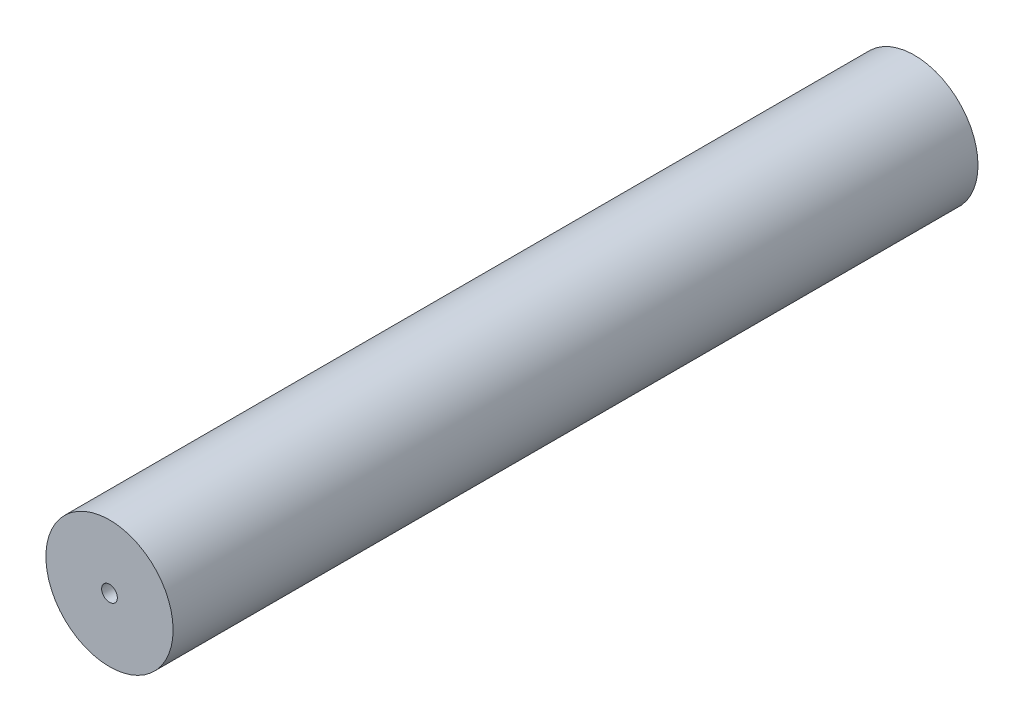
ISO-10303-21;
HEADER;
FILE_DESCRIPTION(('STEP AP214'),'2;1');
FILE_NAME('part.step','',(''),(''),'','','');
FILE_SCHEMA(('AUTOMOTIVE_DESIGN { 1 0 10303 214 1 1 1 1 }'));
ENDSEC;
DATA;
#1=APPLICATION_CONTEXT('core data for automotive mechanical design processes');
#2=APPLICATION_PROTOCOL_DEFINITION('international standard','automotive_design',2000,#1);
#3=PRODUCT_CONTEXT('',#1,'mechanical');
#4=PRODUCT('Part','Part','',(#3));
#5=PRODUCT_RELATED_PRODUCT_CATEGORY('part','',(#4));
#6=PRODUCT_DEFINITION_FORMATION('','',#4);
#7=PRODUCT_DEFINITION_CONTEXT('part definition',#1,'design');
#8=PRODUCT_DEFINITION('design','',#6,#7);
#9=PRODUCT_DEFINITION_SHAPE('','',#8);
#10=(LENGTH_UNIT() NAMED_UNIT(*) SI_UNIT(.MILLI.,.METRE.));
#11=(NAMED_UNIT(*) PLANE_ANGLE_UNIT() SI_UNIT($,.RADIAN.));
#12=(NAMED_UNIT(*) SI_UNIT($,.STERADIAN.) SOLID_ANGLE_UNIT());
#13=UNCERTAINTY_MEASURE_WITH_UNIT(LENGTH_MEASURE(1.E-05),#10,'distance_accuracy_value','');
#14=(GEOMETRIC_REPRESENTATION_CONTEXT(3) GLOBAL_UNCERTAINTY_ASSIGNED_CONTEXT((#13)) GLOBAL_UNIT_ASSIGNED_CONTEXT((#10,
#11,#12)) REPRESENTATION_CONTEXT('',''));
#15=CARTESIAN_POINT('',(0.,0.,0.));
#16=DIRECTION('',(0.,0.,1.));
#17=DIRECTION('',(1.,0.,0.));
#18=AXIS2_PLACEMENT_3D('',#15,#16,#17);
#19=CARTESIAN_POINT('',(0.,0.,40.));
#20=DIRECTION('',(0.,0.,-1.));
#21=DIRECTION('',(-1.,0.,0.));
#22=AXIS2_PLACEMENT_3D('',#19,#20,#21);
#23=CYLINDRICAL_SURFACE('',#22,3.16103);
#24=CARTESIAN_POINT('',(0.,0.,40.));
#25=DIRECTION('',(0.,0.,1.));
#26=DIRECTION('',(1.,0.,0.));
#27=AXIS2_PLACEMENT_3D('',#24,#25,#26);
#28=CIRCLE('',#27,3.16103);
#29=CARTESIAN_POINT('',(3.16103,0.,40.));
#30=VERTEX_POINT('',#29);
#31=EDGE_CURVE('E10',#30,#30,#28,.T.);
#32=ORIENTED_EDGE('',*,*,#31,.F.);
#33=EDGE_LOOP('',(#32));
#34=FACE_BOUND('',#33,.T.);
#35=CARTESIAN_POINT('',(0.,0.,0.));
#36=DIRECTION('',(0.,0.,1.));
#37=DIRECTION('',(1.,0.,0.));
#38=AXIS2_PLACEMENT_3D('',#35,#36,#37);
#39=CIRCLE('',#38,3.16103);
#40=CARTESIAN_POINT('',(3.16103,0.,0.));
#41=VERTEX_POINT('',#40);
#42=EDGE_CURVE('E32',#41,#41,#39,.T.);
#43=ORIENTED_EDGE('',*,*,#42,.T.);
#44=EDGE_LOOP('',(#43));
#45=FACE_BOUND('',#44,.T.);
#46=ADVANCED_FACE('F29',(#34,#45),#23,.T.);
#47=CARTESIAN_POINT('',(0.,0.,40.));
#48=DIRECTION('',(0.,0.,1.));
#49=DIRECTION('',(1.,0.,0.));
#50=AXIS2_PLACEMENT_3D('',#47,#48,#49);
#51=PLANE('',#50);
#52=CARTESIAN_POINT('',(0.,0.,40.));
#53=DIRECTION('',(0.,0.,1.));
#54=DIRECTION('',(1.,0.,0.));
#55=AXIS2_PLACEMENT_3D('',#52,#53,#54);
#56=CIRCLE('',#55,0.39);
#57=CARTESIAN_POINT('',(0.39,0.,40.));
#58=VERTEX_POINT('',#57);
#59=EDGE_CURVE('E43',#58,#58,#56,.T.);
#60=ORIENTED_EDGE('',*,*,#59,.F.);
#61=EDGE_LOOP('',(#60));
#62=FACE_BOUND('',#61,.T.);
#63=ORIENTED_EDGE('',*,*,#31,.T.);
#64=EDGE_LOOP('',(#63));
#65=FACE_BOUND('',#64,.T.);
#66=ADVANCED_FACE('F50',(#62,#65),#51,.T.);
#67=CARTESIAN_POINT('',(0.,0.,0.));
#68=DIRECTION('',(0.,0.,1.));
#69=DIRECTION('',(1.,0.,0.));
#70=AXIS2_PLACEMENT_3D('',#67,#68,#69);
#71=PLANE('',#70);
#72=CARTESIAN_POINT('',(0.,0.,0.));
#73=DIRECTION('',(0.,0.,1.));
#74=DIRECTION('',(1.,0.,0.));
#75=AXIS2_PLACEMENT_3D('',#72,#73,#74);
#76=CIRCLE('',#75,0.39);
#77=CARTESIAN_POINT('',(0.39,0.,0.));
#78=VERTEX_POINT('',#77);
#79=EDGE_CURVE('E39',#78,#78,#76,.F.);
#80=ORIENTED_EDGE('',*,*,#79,.F.);
#81=EDGE_LOOP('',(#80));
#82=FACE_BOUND('',#81,.T.);
#83=ORIENTED_EDGE('',*,*,#42,.F.);
#84=EDGE_LOOP('',(#83));
#85=FACE_BOUND('',#84,.T.);
#86=ADVANCED_FACE('F52',(#82,#85),#71,.F.);
#87=CARTESIAN_POINT('',(0.,0.,-0.001000000000001));
#88=DIRECTION('',(0.,0.,1.));
#89=DIRECTION('',(1.,0.,0.));
#90=AXIS2_PLACEMENT_3D('',#87,#88,#89);
#91=CYLINDRICAL_SURFACE('',#90,0.39);
#92=ORIENTED_EDGE('',*,*,#59,.T.);
#93=EDGE_LOOP('',(#92));
#94=FACE_BOUND('',#93,.T.);
#95=ORIENTED_EDGE('',*,*,#79,.T.);
#96=EDGE_LOOP('',(#95));
#97=FACE_BOUND('',#96,.T.);
#98=ADVANCED_FACE('F47',(#94,#97),#91,.F.);
#99=CLOSED_SHELL('',(#46,#66,#86,#98));
#100=MANIFOLD_SOLID_BREP('B2',#99);
#101=ADVANCED_BREP_SHAPE_REPRESENTATION('',(#18,#100),#14);
#102=SHAPE_DEFINITION_REPRESENTATION(#9,#101);
ENDSEC;
END-ISO-10303-21;
